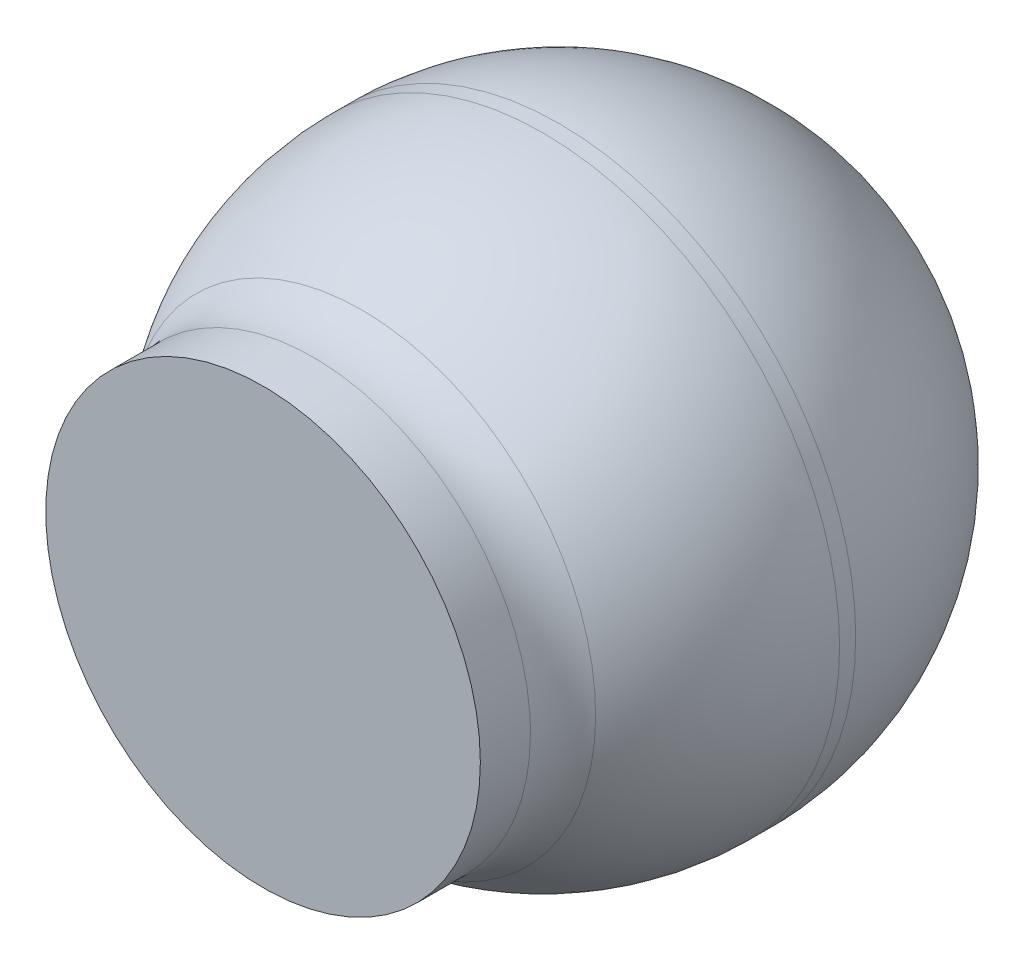
ISO-10303-21;
HEADER;
FILE_DESCRIPTION(('STEP AP214'),'2;1');
FILE_NAME('part.step','',(''),(''),'','','');
FILE_SCHEMA(('AUTOMOTIVE_DESIGN { 1 0 10303 214 1 1 1 1 }'));
ENDSEC;
DATA;
#1=APPLICATION_CONTEXT('core data for automotive mechanical design processes');
#2=APPLICATION_PROTOCOL_DEFINITION('international standard','automotive_design',2000,#1);
#3=PRODUCT_CONTEXT('',#1,'mechanical');
#4=PRODUCT('Part','Part','',(#3));
#5=PRODUCT_RELATED_PRODUCT_CATEGORY('part','',(#4));
#6=PRODUCT_DEFINITION_FORMATION('','',#4);
#7=PRODUCT_DEFINITION_CONTEXT('part definition',#1,'design');
#8=PRODUCT_DEFINITION('design','',#6,#7);
#9=PRODUCT_DEFINITION_SHAPE('','',#8);
#10=(LENGTH_UNIT() NAMED_UNIT(*) SI_UNIT(.MILLI.,.METRE.));
#11=(NAMED_UNIT(*) PLANE_ANGLE_UNIT() SI_UNIT($,.RADIAN.));
#12=(NAMED_UNIT(*) SI_UNIT($,.STERADIAN.) SOLID_ANGLE_UNIT());
#13=UNCERTAINTY_MEASURE_WITH_UNIT(LENGTH_MEASURE(1.E-05),#10,'distance_accuracy_value','');
#14=(GEOMETRIC_REPRESENTATION_CONTEXT(3) GLOBAL_UNCERTAINTY_ASSIGNED_CONTEXT((#13)) GLOBAL_UNIT_ASSIGNED_CONTEXT((#10,
#11,#12)) REPRESENTATION_CONTEXT('',''));
#15=CARTESIAN_POINT('',(0.,0.,0.));
#16=DIRECTION('',(0.,0.,1.));
#17=DIRECTION('',(1.,0.,0.));
#18=AXIS2_PLACEMENT_3D('',#15,#16,#17);
#19=CARTESIAN_POINT('',(-5.642919922269,-0.241349291452,10.006534503384));
#20=DIRECTION('',(0.,0.,-1.));
#21=DIRECTION('',(-1.,0.,0.));
#22=AXIS2_PLACEMENT_3D('',#19,#20,#21);
#23=PLANE('',#22);
#24=CARTESIAN_POINT('',(-5.642919922269,-0.241349291452,10.006534503384));
#25=DIRECTION('',(0.,0.,1.));
#26=DIRECTION('',(1.,0.,0.));
#27=AXIS2_PLACEMENT_3D('',#24,#25,#26);
#28=CIRCLE('',#27,0.275);
#29=CARTESIAN_POINT('',(-5.367919922269,-0.241349291452,10.006534503384));
#30=VERTEX_POINT('',#29);
#31=EDGE_CURVE('E20',#30,#30,#28,.F.);
#32=ORIENTED_EDGE('',*,*,#31,.F.);
#33=EDGE_LOOP('',(#32));
#34=FACE_BOUND('',#33,.T.);
#35=ADVANCED_FACE('F17',(#34),#23,.F.);
#36=CARTESIAN_POINT('',(-5.642919922269,-0.241349291452,9.906534503384));
#37=DIRECTION('',(0.,0.,1.));
#38=DIRECTION('',(1.,0.,0.));
#39=AXIS2_PLACEMENT_3D('',#36,#37,#38);
#40=CYLINDRICAL_SURFACE('',#39,0.275);
#41=CARTESIAN_POINT('',(-5.642919922269,-0.241349291452,9.943180457728));
#42=DIRECTION('',(0.,0.,-1.));
#43=DIRECTION('',(0.996700902337582,0.0811622527992461,0.));
#44=AXIS2_PLACEMENT_3D('',#41,#42,#43);
#45=CIRCLE('',#44,0.275);
#46=CARTESIAN_POINT('',(-5.36882717412616,-0.219029671932207,9.943180457728));
#47=VERTEX_POINT('',#46);
#48=EDGE_CURVE('E65',#47,#47,#45,.F.);
#49=ORIENTED_EDGE('',*,*,#48,.T.);
#50=EDGE_LOOP('',(#49));
#51=FACE_BOUND('',#50,.T.);
#52=ORIENTED_EDGE('',*,*,#31,.T.);
#53=EDGE_LOOP('',(#52));
#54=FACE_BOUND('',#53,.T.);
#55=ADVANCED_FACE('F62',(#51,#54),#40,.T.);
#56=CARTESIAN_POINT('',(-5.642919922269,-0.241349291452,9.943180457728));
#57=DIRECTION('',(0.,0.,-1.));
#58=DIRECTION('',(0.996700902337583,0.081162252799246,0.));
#59=AXIS2_PLACEMENT_3D('',#56,#57,#58);
#60=TOROIDAL_SURFACE('',#59,0.375,0.1);
#61=ORIENTED_EDGE('',*,*,#48,.F.);
#62=EDGE_LOOP('',(#61));
#63=FACE_BOUND('',#62,.T.);
#64=CARTESIAN_POINT('',(-5.642919922269,-0.241349291452,9.881744931236));
#65=DIRECTION('',(0.,0.,-1.));
#66=DIRECTION('',(-0.996700902337598,-0.0811622527990604,0.));
#67=AXIS2_PLACEMENT_3D('',#64,#65,#66);
#68=CIRCLE('',#67,0.296097046412666);
#69=CARTESIAN_POINT('',(-5.938040115608,-0.265381194786,9.881744931236));
#70=VERTEX_POINT('',#69);
#71=EDGE_CURVE('E39',#70,#70,#68,.T.);
#72=ORIENTED_EDGE('',*,*,#71,.F.);
#73=EDGE_LOOP('',(#72));
#74=FACE_BOUND('',#73,.T.);
#75=ADVANCED_FACE('F57',(#63,#74),#60,.F.);
#76=CARTESIAN_POINT('',(-6.016682760645,-0.271785136252,9.651976062157));
#77=CARTESIAN_POINT('',(-6.016682760645,-0.271785136252,9.701461392103));
#78=CARTESIAN_POINT('',(-6.008526217348,-0.271120941579,9.750947004335));
#79=CARTESIAN_POINT('',(-5.992207085349,-0.269792059952,9.798626332798));
#80=CARTESIAN_POINT('',(-5.968341390838,-0.267848654938,9.842699544317));
#81=CARTESIAN_POINT('',(-5.938040115608,-0.265381194786,9.881744931236));
#82=(BOUNDED_CURVE() B_SPLINE_CURVE(5,(#76,#77,#78,#79,#80,#81),.UNSPECIFIED.,.F.,
.F.) B_SPLINE_CURVE_WITH_KNOTS((6,6),(0.,0.661568582165),
.UNSPECIFIED.) CURVE() GEOMETRIC_REPRESENTATION_ITEM() RATIONAL_B_SPLINE_CURVE((1.,1.,1.,1.,1.,1.)) REPRESENTATION_ITEM(''));
#83=CARTESIAN_POINT('',(-5.642919922269,-0.241349291452,9.651976062157));
#84=DIRECTION('',(0.,0.,-1.));
#85=AXIS1_PLACEMENT('',#83,#84);
#86=SURFACE_OF_REVOLUTION('',#82,#85);
#87=CARTESIAN_POINT('',(-5.642919922269,-0.241349291452,9.651976062157));
#88=DIRECTION('',(0.,0.,1.));
#89=DIRECTION('',(1.,0.,0.));
#90=AXIS2_PLACEMENT_3D('',#87,#88,#89);
#91=CIRCLE('',#90,0.375);
#92=CARTESIAN_POINT('',(-5.267919922269,-0.241349291452,9.651976062157));
#93=VERTEX_POINT('',#92);
#94=EDGE_CURVE('E36',#93,#93,#91,.F.);
#95=ORIENTED_EDGE('',*,*,#94,.F.);
#96=EDGE_LOOP('',(#95));
#97=FACE_BOUND('',#96,.T.);
#98=ORIENTED_EDGE('',*,*,#71,.T.);
#99=EDGE_LOOP('',(#98));
#100=FACE_BOUND('',#99,.T.);
#101=ADVANCED_FACE('F53',(#97,#100),#86,.F.);
#102=CARTESIAN_POINT('',(-5.642919922269,-0.241349291452,9.256534503384));
#103=DIRECTION('',(0.,0.,1.));
#104=DIRECTION('',(1.,0.,0.));
#105=AXIS2_PLACEMENT_3D('',#102,#103,#104);
#106=CYLINDRICAL_SURFACE('',#105,0.375);
#107=CARTESIAN_POINT('',(-5.642919922269,-0.241349291452,9.631534503384));
#108=DIRECTION('',(0.,0.,-1.));
#109=DIRECTION('',(0.0811622527992356,-0.996700902337583,0.));
#110=AXIS2_PLACEMENT_3D('',#107,#108,#109);
#111=CIRCLE('',#110,0.375);
#112=CARTESIAN_POINT('',(-5.61248407746929,-0.615112129828594,9.631534503384));
#113=VERTEX_POINT('',#112);
#114=CARTESIAN_POINT('',(-5.67335576706871,0.132413546924594,9.631534503384));
#115=VERTEX_POINT('',#114);
#116=EDGE_CURVE('E11',#113,#115,#111,.T.);
#117=ORIENTED_EDGE('',*,*,#116,.F.);
#118=CARTESIAN_POINT('',(-5.642919922269,-0.241349291452,9.631534503384));
#119=DIRECTION('',(0.,0.,1.));
#120=DIRECTION('',(0.0811622527992365,-0.996700902337583,0.));
#121=AXIS2_PLACEMENT_3D('',#118,#119,#120);
#122=CIRCLE('',#121,0.375);
#123=EDGE_CURVE('E25',#115,#113,#122,.F.);
#124=ORIENTED_EDGE('',*,*,#123,.F.);
#125=EDGE_LOOP('',(#117,#124));
#126=FACE_BOUND('',#125,.T.);
#127=ORIENTED_EDGE('',*,*,#94,.T.);
#128=EDGE_LOOP('',(#127));
#129=FACE_BOUND('',#128,.T.);
#130=ADVANCED_FACE('F34',(#126,#129),#106,.T.);
#131=CARTESIAN_POINT('',(-5.642919922269,-0.241349291452,9.631534503384));
#132=DIRECTION('',(0.0811622527992361,-0.996700902337583,0.));
#133=DIRECTION('',(-0.996700902337583,-0.0811622527992361,0.));
#134=AXIS2_PLACEMENT_3D('',#131,#132,#133);
#135=SPHERICAL_SURFACE('',#134,0.375);
#136=ORIENTED_EDGE('',*,*,#123,.T.);
#137=ORIENTED_EDGE('',*,*,#116,.T.);
#138=EDGE_LOOP('',(#136,#137));
#139=FACE_BOUND('',#138,.T.);
#140=ADVANCED_FACE('F32',(#139),#135,.T.);
#141=CLOSED_SHELL('',(#35,#55,#75,#101,#130,#140));
#142=MANIFOLD_SOLID_BREP('B1',#141);
#143=ADVANCED_BREP_SHAPE_REPRESENTATION('',(#18,#142),#14);
#144=SHAPE_DEFINITION_REPRESENTATION(#9,#143);
ENDSEC;
END-ISO-10303-21;
